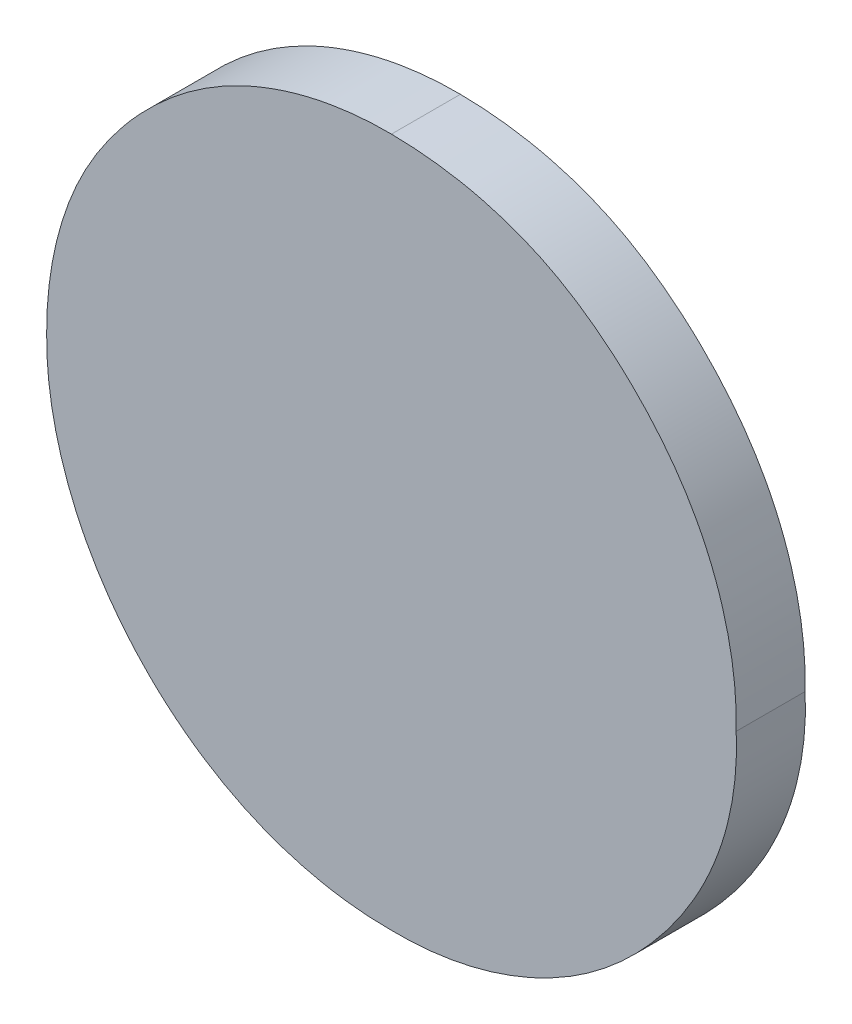
ISO-10303-21;
HEADER;
FILE_DESCRIPTION(('STEP AP214'),'2;1');
FILE_NAME('part.step','',(''),(''),'','','');
FILE_SCHEMA(('AUTOMOTIVE_DESIGN { 1 0 10303 214 1 1 1 1 }'));
ENDSEC;
DATA;
#1=APPLICATION_CONTEXT('core data for automotive mechanical design processes');
#2=APPLICATION_PROTOCOL_DEFINITION('international standard','automotive_design',2000,#1);
#3=PRODUCT_CONTEXT('',#1,'mechanical');
#4=PRODUCT('Part','Part','',(#3));
#5=PRODUCT_RELATED_PRODUCT_CATEGORY('part','',(#4));
#6=PRODUCT_DEFINITION_FORMATION('','',#4);
#7=PRODUCT_DEFINITION_CONTEXT('part definition',#1,'design');
#8=PRODUCT_DEFINITION('design','',#6,#7);
#9=PRODUCT_DEFINITION_SHAPE('','',#8);
#10=(LENGTH_UNIT() NAMED_UNIT(*) SI_UNIT(.MILLI.,.METRE.));
#11=(NAMED_UNIT(*) PLANE_ANGLE_UNIT() SI_UNIT($,.RADIAN.));
#12=(NAMED_UNIT(*) SI_UNIT($,.STERADIAN.) SOLID_ANGLE_UNIT());
#13=UNCERTAINTY_MEASURE_WITH_UNIT(LENGTH_MEASURE(1.E-05),#10,'distance_accuracy_value','');
#14=(GEOMETRIC_REPRESENTATION_CONTEXT(3) GLOBAL_UNCERTAINTY_ASSIGNED_CONTEXT((#13)) GLOBAL_UNIT_ASSIGNED_CONTEXT((#10,
#11,#12)) REPRESENTATION_CONTEXT('',''));
#15=CARTESIAN_POINT('',(0.,0.,0.));
#16=DIRECTION('',(0.,0.,1.));
#17=DIRECTION('',(1.,0.,0.));
#18=AXIS2_PLACEMENT_3D('',#15,#16,#17);
#19=CARTESIAN_POINT('',(0.39923076923077,0.863114725391158,0.551));
#20=CARTESIAN_POINT('',(0.39923076923077,0.863114725391158,0.55));
#21=CARTESIAN_POINT('',(0.399248976646578,0.86345328618512,0.551));
#22=CARTESIAN_POINT('',(0.399248976646578,0.86345328618512,0.55));
#23=CARTESIAN_POINT('',(0.399284524391418,0.864114284585097,0.551));
#24=CARTESIAN_POINT('',(0.399284524391418,0.864114284585097,0.55));
#25=CARTESIAN_POINT('',(0.399572107138592,0.865060554998996,0.551));
#26=CARTESIAN_POINT('',(0.399572107138592,0.865060554998996,0.55));
#27=CARTESIAN_POINT('',(0.400041413628388,0.86592058538614,0.551));
#28=CARTESIAN_POINT('',(0.400041413628388,0.86592058538614,0.55));
#29=CARTESIAN_POINT('',(0.400675791828254,0.86668166961683,0.551));
#30=CARTESIAN_POINT('',(0.400675791828254,0.86668166961683,0.55));
#31=CARTESIAN_POINT('',(0.401439065472057,0.867319166233957,0.551));
#32=CARTESIAN_POINT('',(0.401439065472057,0.867319166233957,0.55));
#33=CARTESIAN_POINT('',(0.402301286132251,0.867783134116351,0.551));
#34=CARTESIAN_POINT('',(0.402301286132251,0.867783134116351,0.55));
#35=CARTESIAN_POINT('',(0.403244821108891,0.868058112610963,0.551));
#36=CARTESIAN_POINT('',(0.403244821108891,0.868058112610963,0.55));
#37=CARTESIAN_POINT('',(0.403896420053132,0.868095527183786,0.551));
#38=CARTESIAN_POINT('',(0.403896420053132,0.868095527183786,0.55));
#39=CARTESIAN_POINT('',(0.404230769230769,0.868114725391158,0.551));
#40=CARTESIAN_POINT('',(0.404230769230769,0.868114725391158,0.55));
#41=B_SPLINE_SURFACE_WITH_KNOTS('',3,1,((#19,#20),(#21,#22),(#23,#24),(#25,#26),(#27,#28),(#29,
#30),(#31,#32),(#33,#34),(#35,#36),(#37,#38),(#39,#40)),.UNSPECIFIED.,.F.,.F.,.F.,(4,1,1,1,1,1,
1,1,4),(2,2),(0.,0.129096958167213,0.25204596725997,0.373904964401992,0.501037835220204,
0.628170706038407,0.751376463409192,0.872426013370454,1.),(0.,1.),.UNSPECIFIED.);
#42=CARTESIAN_POINT('',(0.39923076923077,0.863114725391158,0.549999999999999));
#43=CARTESIAN_POINT('',(0.399229416497527,0.863455179909153,0.549999999999998));
#44=CARTESIAN_POINT('',(0.399261931137011,0.863797818150182,0.549999999999998));
#45=CARTESIAN_POINT('',(0.39941156061862,0.864551506784289,0.549999999999998));
#46=CARTESIAN_POINT('',(0.399547312142089,0.864958950611587,0.549999999999999));
#47=CARTESIAN_POINT('',(0.399928651852269,0.865725440329336,0.549999999999999));
#48=CARTESIAN_POINT('',(0.400175898556821,0.866083644707447,0.549999999999999));
#49=CARTESIAN_POINT('',(0.400803185242246,0.866798794998221,0.549999999999999));
#50=CARTESIAN_POINT('',(0.401199822238856,0.867141460959453,0.55));
#51=CARTESIAN_POINT('',(0.402044650722195,0.867655274628973,0.550000000000002));
#52=CARTESIAN_POINT('',(0.402485184515487,0.867838907435263,0.550000000000002));
#53=CARTESIAN_POINT('',(0.403363138264506,0.868066009062203,0.550000000000004));
#54=CARTESIAN_POINT('',(0.403797973311028,0.868119539716685,0.550000000000004));
#55=CARTESIAN_POINT('',(0.404230769230769,0.868114725391158,0.550000000000005));
#56=B_SPLINE_CURVE_WITH_KNOTS('',3,(#42,#43,#44,#45,#46,#47,#48,#49,#50,#51,#52,#53,#54,#55),
.UNSPECIFIED.,.F.,.F.,(4,2,2,2,2,2,4),(0.,0.00102380235934378,0.0022963706716671,
0.0035885272384339,0.00513641999990452,0.0065474697181893,0.00784533010584649),.UNSPECIFIED.);
#57=CARTESIAN_POINT('',(0.39923076923077,0.863114725391158,0.55));
#58=VERTEX_POINT('',#57);
#59=CARTESIAN_POINT('',(0.404230769230769,0.868114725391158,0.55));
#60=VERTEX_POINT('',#59);
#61=EDGE_CURVE('E11',#58,#60,#56,.T.);
#62=DIRECTION('',(0.,-1.11022302462503E-13,-1.));
#63=VECTOR('',#62,1.);
#64=CARTESIAN_POINT('',(0.39923076923077,0.863114725391158,0.551));
#65=LINE('',#64,#63);
#66=CARTESIAN_POINT('',(0.39923076923077,0.863114725391158,0.551));
#67=VERTEX_POINT('',#66);
#68=EDGE_CURVE('E135',#67,#58,#65,.T.);
#69=CARTESIAN_POINT('',(0.39923076923077,0.863114725391158,0.550999999999998));
#70=CARTESIAN_POINT('',(0.399229416497527,0.863455179909153,0.550999999999998));
#71=CARTESIAN_POINT('',(0.399261931137011,0.863797818150182,0.550999999999998));
#72=CARTESIAN_POINT('',(0.39941156061862,0.864551506784289,0.550999999999998));
#73=CARTESIAN_POINT('',(0.399547312142089,0.864958950611587,0.550999999999999));
#74=CARTESIAN_POINT('',(0.399928651852269,0.865725440329336,0.550999999999999));
#75=CARTESIAN_POINT('',(0.400175898556821,0.866083644707447,0.551));
#76=CARTESIAN_POINT('',(0.400803185242246,0.866798794998221,0.551));
#77=CARTESIAN_POINT('',(0.401199822238856,0.867141460959453,0.551));
#78=CARTESIAN_POINT('',(0.402044650722195,0.867655274628973,0.551000000000001));
#79=CARTESIAN_POINT('',(0.402485184515487,0.867838907435263,0.551000000000002));
#80=CARTESIAN_POINT('',(0.403363138264506,0.868066009062203,0.551000000000004));
#81=CARTESIAN_POINT('',(0.403797973311028,0.868119539716685,0.551000000000004));
#82=CARTESIAN_POINT('',(0.404230769230769,0.868114725391158,0.551000000000005));
#83=B_SPLINE_CURVE_WITH_KNOTS('',3,(#69,#70,#71,#72,#73,#74,#75,#76,#77,#78,#79,#80,#81,#82),
.UNSPECIFIED.,.F.,.F.,(4,2,2,2,2,2,4),(0.,0.00102380235934378,0.0022963706716671,
0.0035885272384339,0.00513641999990452,0.0065474697181893,0.00784533010584649),.UNSPECIFIED.);
#84=CARTESIAN_POINT('',(0.404230769230769,0.868114725391158,0.551));
#85=VERTEX_POINT('',#84);
#86=EDGE_CURVE('E143',#67,#85,#83,.T.);
#87=DIRECTION('',(0.,0.,-1.));
#88=VECTOR('',#87,1.);
#89=CARTESIAN_POINT('',(0.404230769230769,0.868114725391158,0.551));
#90=LINE('',#89,#88);
#91=EDGE_CURVE('E80',#85,#60,#90,.T.);
#92=ORIENTED_EDGE('',*,*,#61,.F.);
#93=ORIENTED_EDGE('',*,*,#68,.F.);
#94=ORIENTED_EDGE('',*,*,#86,.T.);
#95=ORIENTED_EDGE('',*,*,#91,.T.);
#96=EDGE_LOOP('',(#92,#93,#94,#95));
#97=FACE_BOUND('',#96,.T.);
#98=ADVANCED_FACE('F17',(#97),#41,.T.);
#99=CARTESIAN_POINT('',(0.404230769230769,0.858114725391158,0.551));
#100=CARTESIAN_POINT('',(0.404230769230769,0.858114725391158,0.55));
#101=CARTESIAN_POINT('',(0.403896039419594,0.858132615628453,0.551));
#102=CARTESIAN_POINT('',(0.403896039419594,0.858132615628453,0.55));
#103=CARTESIAN_POINT('',(0.403242559146144,0.858167542057975,0.551));
#104=CARTESIAN_POINT('',(0.403242559146144,0.858167542057975,0.55));
#105=CARTESIAN_POINT('',(0.402303370673627,0.858461761594175,0.551));
#106=CARTESIAN_POINT('',(0.402303370673627,0.858461761594175,0.55));
#107=CARTESIAN_POINT('',(0.401439251212277,0.858921592341211,0.551));
#108=CARTESIAN_POINT('',(0.401439251212277,0.858921592341211,0.55));
#109=CARTESIAN_POINT('',(0.400671461868215,0.859560453646627,0.551));
#110=CARTESIAN_POINT('',(0.400671461868215,0.859560453646627,0.55));
#111=CARTESIAN_POINT('',(0.400045088069561,0.860331884676267,0.551));
#112=CARTESIAN_POINT('',(0.400045088069561,0.860331884676267,0.55));
#113=CARTESIAN_POINT('',(0.399571510077796,0.861192486900813,0.551));
#114=CARTESIAN_POINT('',(0.399571510077796,0.861192486900813,0.55));
#115=CARTESIAN_POINT('',(0.399287107524317,0.862131597256498,0.551));
#116=CARTESIAN_POINT('',(0.399287107524317,0.862131597256498,0.55));
#117=CARTESIAN_POINT('',(0.399249703992885,0.862784305419475,0.551));
#118=CARTESIAN_POINT('',(0.399249703992885,0.862784305419475,0.55));
#119=CARTESIAN_POINT('',(0.39923076923077,0.863114725391158,0.551));
#120=CARTESIAN_POINT('',(0.39923076923077,0.863114725391158,0.55));
#121=B_SPLINE_SURFACE_WITH_KNOTS('',3,1,((#99,#100),(#101,#102),(#103,#104),(#105,#106),(#107,
#108),(#109,#110),(#111,#112),(#113,#114),(#115,#116),(#117,#118),(#119,#120)),.UNSPECIFIED.,
.F.,.F.,.F.,(4,1,1,1,1,1,1,1,4),(2,2),(0.,0.127756603310128,0.24941435533653,0.37279647645539,
0.500111332515853,0.628609940765106,0.750643373825806,0.873768379142504,1.),(0.,1.),.UNSPECIFIED.);
#122=CARTESIAN_POINT('',(0.404230769230769,0.858114725391158,0.550000000000007));
#123=CARTESIAN_POINT('',(0.403893267940405,0.858112502108592,0.550000000000007));
#124=CARTESIAN_POINT('',(0.40355517942209,0.858145582789583,0.550000000000006));
#125=CARTESIAN_POINT('',(0.402814894762664,0.858295330803168,0.550000000000005));
#126=CARTESIAN_POINT('',(0.402416205449739,0.858429742888755,0.550000000000005));
#127=CARTESIAN_POINT('',(0.401597885990938,0.858830577938308,0.550000000000003));
#128=CARTESIAN_POINT('',(0.401187846528188,0.859116704584057,0.550000000000003));
#129=CARTESIAN_POINT('',(0.40046227781435,0.859795571446889,0.550000000000001));
#130=CARTESIAN_POINT('',(0.400147659108904,0.860189274590438,0.550000000000001));
#131=CARTESIAN_POINT('',(0.399652955060885,0.86104222215107,0.549999999999999));
#132=CARTESIAN_POINT('',(0.399469879770227,0.861499707407872,0.549999999999999));
#133=CARTESIAN_POINT('',(0.399269705395969,0.862347008753727,0.549999999999999));
#134=CARTESIAN_POINT('',(0.399225701117548,0.862730685884953,0.549999999999999));
#135=CARTESIAN_POINT('',(0.39923076923077,0.863114725391158,0.549999999999999));
#136=B_SPLINE_CURVE_WITH_KNOTS('',3,(#122,#123,#124,#125,#126,#127,#128,#129,#130,#131,#132,
#133,#134,#135),.UNSPECIFIED.,.F.,.F.,(4,2,2,2,2,2,4),(0.,0.00101171540563026,
0.00226012530857961,0.00373770364104088,0.00522896754963452,0.00668515982761436,
0.00783352206638498),.UNSPECIFIED.);
#137=CARTESIAN_POINT('',(0.404230769230769,0.858114725391158,0.55));
#138=VERTEX_POINT('',#137);
#139=EDGE_CURVE('E32',#138,#58,#136,.T.);
#140=DIRECTION('',(0.,0.,-1.));
#141=VECTOR('',#140,1.);
#142=CARTESIAN_POINT('',(0.404230769230769,0.858114725391158,0.551));
#143=LINE('',#142,#141);
#144=CARTESIAN_POINT('',(0.404230769230769,0.858114725391158,0.551));
#145=VERTEX_POINT('',#144);
#146=EDGE_CURVE('E142',#145,#138,#143,.T.);
#147=CARTESIAN_POINT('',(0.404230769230769,0.858114725391158,0.551000000000007));
#148=CARTESIAN_POINT('',(0.403893267940405,0.858112502108592,0.551000000000007));
#149=CARTESIAN_POINT('',(0.40355517942209,0.858145582789583,0.551000000000006));
#150=CARTESIAN_POINT('',(0.402814894762664,0.858295330803168,0.551000000000005));
#151=CARTESIAN_POINT('',(0.402416205449739,0.858429742888755,0.551000000000005));
#152=CARTESIAN_POINT('',(0.401597885990938,0.858830577938308,0.551000000000003));
#153=CARTESIAN_POINT('',(0.401187846528188,0.859116704584057,0.551000000000003));
#154=CARTESIAN_POINT('',(0.40046227781435,0.859795571446889,0.551000000000001));
#155=CARTESIAN_POINT('',(0.400147659108904,0.860189274590438,0.551));
#156=CARTESIAN_POINT('',(0.399652955060885,0.86104222215107,0.550999999999999));
#157=CARTESIAN_POINT('',(0.399469879770227,0.861499707407872,0.550999999999999));
#158=CARTESIAN_POINT('',(0.399269705395969,0.862347008753727,0.550999999999999));
#159=CARTESIAN_POINT('',(0.399225701117548,0.862730685884953,0.550999999999998));
#160=CARTESIAN_POINT('',(0.39923076923077,0.863114725391158,0.550999999999998));
#161=B_SPLINE_CURVE_WITH_KNOTS('',3,(#147,#148,#149,#150,#151,#152,#153,#154,#155,#156,#157,
#158,#159,#160),.UNSPECIFIED.,.F.,.F.,(4,2,2,2,2,2,4),(0.,0.00101171540563026,
0.00226012530857961,0.00373770364104088,0.00522896754963452,0.00668515982761436,
0.00783352206638498),.UNSPECIFIED.);
#162=EDGE_CURVE('E74',#145,#67,#161,.T.);
#163=ORIENTED_EDGE('',*,*,#139,.F.);
#164=ORIENTED_EDGE('',*,*,#146,.F.);
#165=ORIENTED_EDGE('',*,*,#162,.T.);
#166=ORIENTED_EDGE('',*,*,#68,.T.);
#167=EDGE_LOOP('',(#163,#164,#165,#166));
#168=FACE_BOUND('',#167,.T.);
#169=ADVANCED_FACE('F118',(#168),#121,.T.);
#170=CARTESIAN_POINT('',(0.40923076923077,0.863114725391158,0.551));
#171=CARTESIAN_POINT('',(0.40923076923077,0.863114725391158,0.55));
#172=CARTESIAN_POINT('',(0.40921027321799,0.862784839738087,0.551));
#173=CARTESIAN_POINT('',(0.40921027321799,0.862784839738087,0.55));
#174=CARTESIAN_POINT('',(0.409169855381791,0.862134310074904,0.551));
#175=CARTESIAN_POINT('',(0.409169855381791,0.862134310074904,0.55));
#176=CARTESIAN_POINT('',(0.408908210671009,0.861186627858494,0.551));
#177=CARTESIAN_POINT('',(0.408908210671009,0.861186627858494,0.55));
#178=CARTESIAN_POINT('',(0.408412815524208,0.860335880924721,0.551));
#179=CARTESIAN_POINT('',(0.408412815524208,0.860335880924721,0.55));
#180=CARTESIAN_POINT('',(0.407791644216968,0.859559272842521,0.551));
#181=CARTESIAN_POINT('',(0.407791644216968,0.859559272842521,0.55));
#182=CARTESIAN_POINT('',(0.40702370535597,0.858926000774952,0.551));
#183=CARTESIAN_POINT('',(0.40702370535597,0.858926000774952,0.55));
#184=CARTESIAN_POINT('',(0.406164816560152,0.858455886293827,0.551));
#185=CARTESIAN_POINT('',(0.406164816560152,0.858455886293827,0.55));
#186=CARTESIAN_POINT('',(0.405222109277459,0.858169738066809,0.551));
#187=CARTESIAN_POINT('',(0.405222109277459,0.858169738066809,0.55));
#188=CARTESIAN_POINT('',(0.404565258020061,0.858133287259344,0.551));
#189=CARTESIAN_POINT('',(0.404565258020061,0.858133287259344,0.55));
#190=CARTESIAN_POINT('',(0.404230769230769,0.858114725391158,0.551));
#191=CARTESIAN_POINT('',(0.404230769230769,0.858114725391158,0.55));
#192=B_SPLINE_SURFACE_WITH_KNOTS('',3,1,((#170,#171),(#172,#173),(#174,#175),(#176,#177),(#178,
#179),(#180,#181),(#182,#183),(#184,#185),(#186,#187),(#188,#189),(#190,#191)),.UNSPECIFIED.,
.F.,.F.,.F.,(4,1,1,1,1,1,1,1,4),(2,2),(0.,0.126177718317016,0.248820607485794,0.371539969235151,
0.499983706910883,0.627244197875373,0.749225521076267,0.872297950417653,1.),(0.,1.),.UNSPECIFIED.);
#193=CARTESIAN_POINT('',(0.40923076923077,0.863114725391158,0.550000000000014));
#194=CARTESIAN_POINT('',(0.409266179268415,0.862311284791075,0.550000000000014));
#195=CARTESIAN_POINT('',(0.409067723776707,0.8615495939592,0.550000000000014));
#196=CARTESIAN_POINT('',(0.408525951501408,0.86051718944485,0.550000000000014));
#197=CARTESIAN_POINT('',(0.408298908866208,0.860187034192151,0.550000000000014));
#198=CARTESIAN_POINT('',(0.407732286040191,0.859524243865001,0.550000000000012));
#199=CARTESIAN_POINT('',(0.407379595813053,0.859202712064018,0.550000000000011));
#200=CARTESIAN_POINT('',(0.406572495072277,0.858659623609572,0.55000000000001));
#201=CARTESIAN_POINT('',(0.406113429946505,0.858444815631757,0.55000000000001));
#202=CARTESIAN_POINT('',(0.40517827731357,0.858171685319066,0.55000000000001));
#203=CARTESIAN_POINT('',(0.404704438325925,0.858105557819452,0.550000000000009));
#204=CARTESIAN_POINT('',(0.404230769230769,0.858114725391158,0.550000000000007));
#205=B_SPLINE_CURVE_WITH_KNOTS('',3,(#193,#194,#195,#196,#197,#198,#199,#200,#201,#202,#203,
#204),.UNSPECIFIED.,.F.,.F.,(4,2,2,2,2,4),(0.,0.00230515943148697,0.00349686753796256,
0.00491163967330806,0.00640711009768402,0.00782203466010385),.UNSPECIFIED.);
#206=CARTESIAN_POINT('',(0.40923076923077,0.863114725391158,0.55));
#207=VERTEX_POINT('',#206);
#208=EDGE_CURVE('E70',#207,#138,#205,.T.);
#209=DIRECTION('',(0.,-1.11022302462503E-13,-1.));
#210=VECTOR('',#209,1.);
#211=CARTESIAN_POINT('',(0.40923076923077,0.863114725391158,0.551));
#212=LINE('',#211,#210);
#213=CARTESIAN_POINT('',(0.40923076923077,0.863114725391158,0.551));
#214=VERTEX_POINT('',#213);
#215=EDGE_CURVE('E63',#214,#207,#212,.T.);
#216=CARTESIAN_POINT('',(0.40923076923077,0.863114725391158,0.551000000000014));
#217=CARTESIAN_POINT('',(0.409266179268415,0.862311284791075,0.551000000000014));
#218=CARTESIAN_POINT('',(0.409067723776707,0.8615495939592,0.551000000000014));
#219=CARTESIAN_POINT('',(0.408525951501408,0.86051718944485,0.551000000000014));
#220=CARTESIAN_POINT('',(0.408298908866208,0.860187034192151,0.551000000000013));
#221=CARTESIAN_POINT('',(0.407732286040191,0.859524243865001,0.551000000000012));
#222=CARTESIAN_POINT('',(0.407379595813053,0.859202712064018,0.551000000000012));
#223=CARTESIAN_POINT('',(0.406572495072277,0.858659623609572,0.55100000000001));
#224=CARTESIAN_POINT('',(0.406113429946505,0.858444815631757,0.55100000000001));
#225=CARTESIAN_POINT('',(0.40517827731357,0.858171685319066,0.551000000000008));
#226=CARTESIAN_POINT('',(0.404704438325925,0.858105557819452,0.551000000000008));
#227=CARTESIAN_POINT('',(0.404230769230769,0.858114725391158,0.551000000000007));
#228=B_SPLINE_CURVE_WITH_KNOTS('',3,(#216,#217,#218,#219,#220,#221,#222,#223,#224,#225,#226,
#227),.UNSPECIFIED.,.F.,.F.,(4,2,2,2,2,4),(0.,0.00230515943148697,0.00349686753796256,
0.00491163967330806,0.00640711009768402,0.00782203466010385),.UNSPECIFIED.);
#229=EDGE_CURVE('E67',#214,#145,#228,.T.);
#230=ORIENTED_EDGE('',*,*,#208,.F.);
#231=ORIENTED_EDGE('',*,*,#215,.F.);
#232=ORIENTED_EDGE('',*,*,#229,.T.);
#233=ORIENTED_EDGE('',*,*,#146,.T.);
#234=EDGE_LOOP('',(#230,#231,#232,#233));
#235=FACE_BOUND('',#234,.T.);
#236=ADVANCED_FACE('F65',(#235),#192,.T.);
#237=CARTESIAN_POINT('',(0.404230769230769,0.868114725391158,0.551));
#238=CARTESIAN_POINT('',(0.404230769230769,0.868114725391158,0.55));
#239=CARTESIAN_POINT('',(0.404564887153735,0.868094871105105,0.551));
#240=CARTESIAN_POINT('',(0.404564887153735,0.868094871105105,0.55));
#241=CARTESIAN_POINT('',(0.405219886280483,0.868055949098432,0.551));
#242=CARTESIAN_POINT('',(0.405219886280483,0.868055949098432,0.55));
#243=CARTESIAN_POINT('',(0.406166842765899,0.867788920405405,0.551));
#244=CARTESIAN_POINT('',(0.406166842765899,0.867788920405405,0.55));
#245=CARTESIAN_POINT('',(0.407023894075273,0.867314771940176,0.551));
#246=CARTESIAN_POINT('',(0.407023894075273,0.867314771940176,0.55));
#247=CARTESIAN_POINT('',(0.407787303985903,0.866682838596831,0.551));
#248=CARTESIAN_POINT('',(0.407787303985903,0.866682838596831,0.55));
#249=CARTESIAN_POINT('',(0.408416557869175,0.865916627228879,0.551));
#250=CARTESIAN_POINT('',(0.408416557869175,0.865916627228879,0.55));
#251=CARTESIAN_POINT('',(0.408907603905652,0.865066411650546,0.551));
#252=CARTESIAN_POINT('',(0.408907603905652,0.865066411650546,0.55));
#253=CARTESIAN_POINT('',(0.409172306509286,0.864111527206334,0.551));
#254=CARTESIAN_POINT('',(0.409172306509286,0.864111527206334,0.55));
#255=CARTESIAN_POINT('',(0.409210944997468,0.863452732778397,0.551));
#256=CARTESIAN_POINT('',(0.409210944997468,0.863452732778397,0.55));
#257=CARTESIAN_POINT('',(0.40923076923077,0.863114725391158,0.551));
#258=CARTESIAN_POINT('',(0.40923076923077,0.863114725391158,0.55));
#259=B_SPLINE_SURFACE_WITH_KNOTS('',3,1,((#237,#238),(#239,#240),(#241,#242),(#243,#244),(#245,
#246),(#247,#248),(#249,#250),(#251,#252),(#253,#254),(#255,#256),(#257,#258)),.UNSPECIFIED.,
.F.,.F.,.F.,(4,1,1,1,1,1,1,1,4),(2,2),(0.,0.127518926699944,0.249985947748807,0.371792351505759,
0.498870352776476,0.625948354047203,0.748491738016065,0.87095875906493,1.),(0.,1.),.UNSPECIFIED.);
#260=CARTESIAN_POINT('',(0.404230769230769,0.868114725391158,0.550000000000005));
#261=CARTESIAN_POINT('',(0.404565943435557,0.868112097167233,0.550000000000006));
#262=CARTESIAN_POINT('',(0.404904835685436,0.86808049207193,0.550000000000006));
#263=CARTESIAN_POINT('',(0.405676933052458,0.867933136152945,0.550000000000008));
#264=CARTESIAN_POINT('',(0.406105800377027,0.867793791823817,0.550000000000009));
#265=CARTESIAN_POINT('',(0.406885428723778,0.867397345513137,0.550000000000009));
#266=CARTESIAN_POINT('',(0.40723837676596,0.867144479411953,0.55000000000001));
#267=CARTESIAN_POINT('',(0.407951045995354,0.866502517795435,0.550000000000011));
#268=CARTESIAN_POINT('',(0.408294852138018,0.86609563777763,0.550000000000011));
#269=CARTESIAN_POINT('',(0.40878761986035,0.865264762391322,0.550000000000013));
#270=CARTESIAN_POINT('',(0.408959226674588,0.864854403753308,0.550000000000013));
#271=CARTESIAN_POINT('',(0.409186066598336,0.864000714530884,0.550000000000013));
#272=CARTESIAN_POINT('',(0.409240747435176,0.863557237666799,0.550000000000013));
#273=CARTESIAN_POINT('',(0.40923076923077,0.863114725391158,0.550000000000014));
#274=B_SPLINE_CURVE_WITH_KNOTS('',3,(#260,#261,#262,#263,#264,#265,#266,#267,#268,#269,#270,
#271,#272,#273),.UNSPECIFIED.,.F.,.F.,(4,2,2,2,2,2,4),(0.,0.00101182088140826,
0.00234589379881107,0.00363386383792711,0.00520796923801979,0.00652511171315622,
0.00784846178707324),.UNSPECIFIED.);
#275=EDGE_CURVE('E73',#60,#207,#274,.T.);
#276=CARTESIAN_POINT('',(0.404230769230769,0.868114725391158,0.551000000000005));
#277=CARTESIAN_POINT('',(0.404565943435557,0.868112097167233,0.551000000000006));
#278=CARTESIAN_POINT('',(0.404904835685436,0.86808049207193,0.551000000000006));
#279=CARTESIAN_POINT('',(0.405676933052458,0.867933136152945,0.551000000000008));
#280=CARTESIAN_POINT('',(0.406105800377027,0.867793791823817,0.551000000000008));
#281=CARTESIAN_POINT('',(0.406885428723778,0.867397345513137,0.551000000000009));
#282=CARTESIAN_POINT('',(0.40723837676596,0.867144479411953,0.551000000000009));
#283=CARTESIAN_POINT('',(0.407951045995354,0.866502517795435,0.55100000000001));
#284=CARTESIAN_POINT('',(0.408294852138018,0.86609563777763,0.551000000000011));
#285=CARTESIAN_POINT('',(0.40878761986035,0.865264762391322,0.551000000000012));
#286=CARTESIAN_POINT('',(0.408959226674588,0.864854403753308,0.551000000000013));
#287=CARTESIAN_POINT('',(0.409186066598336,0.864000714530884,0.551000000000013));
#288=CARTESIAN_POINT('',(0.409240747435176,0.863557237666799,0.551000000000013));
#289=CARTESIAN_POINT('',(0.40923076923077,0.863114725391158,0.551000000000014));
#290=B_SPLINE_CURVE_WITH_KNOTS('',3,(#276,#277,#278,#279,#280,#281,#282,#283,#284,#285,#286,
#287,#288,#289),.UNSPECIFIED.,.F.,.F.,(4,2,2,2,2,2,4),(0.,0.00101182088140826,
0.00234589379881107,0.00363386383792711,0.00520796923801979,0.00652511171315622,
0.00784846178707324),.UNSPECIFIED.);
#291=EDGE_CURVE('E78',#85,#214,#290,.T.);
#292=ORIENTED_EDGE('',*,*,#275,.F.);
#293=ORIENTED_EDGE('',*,*,#91,.F.);
#294=ORIENTED_EDGE('',*,*,#291,.T.);
#295=ORIENTED_EDGE('',*,*,#215,.T.);
#296=EDGE_LOOP('',(#292,#293,#294,#295));
#297=FACE_BOUND('',#296,.T.);
#298=ADVANCED_FACE('F79',(#297),#259,.T.);
#299=CARTESIAN_POINT('',(0.400691346143458,0.866654615006806,0.551));
#300=DIRECTION('',(-3.09070669770512E-12,4.86453252035292E-13,1.));
#301=DIRECTION('',(1.,0.,3.09070669770512E-12));
#302=AXIS2_PLACEMENT_3D('',#299,#300,#301);
#303=PLANE('',#302);
#304=ORIENTED_EDGE('',*,*,#86,.F.);
#305=ORIENTED_EDGE('',*,*,#162,.F.);
#306=ORIENTED_EDGE('',*,*,#229,.F.);
#307=ORIENTED_EDGE('',*,*,#291,.F.);
#308=EDGE_LOOP('',(#304,#305,#306,#307));
#309=FACE_BOUND('',#308,.T.);
#310=ADVANCED_FACE('F84',(#309),#303,.T.);
#311=CARTESIAN_POINT('',(0.400691346143458,0.866654615006806,0.55));
#312=DIRECTION('',(-3.09070669770512E-12,4.86453252035292E-13,1.));
#313=DIRECTION('',(1.,0.,3.09070669770512E-12));
#314=AXIS2_PLACEMENT_3D('',#311,#312,#313);
#315=PLANE('',#314);
#316=ORIENTED_EDGE('',*,*,#61,.T.);
#317=ORIENTED_EDGE('',*,*,#275,.T.);
#318=ORIENTED_EDGE('',*,*,#208,.T.);
#319=ORIENTED_EDGE('',*,*,#139,.T.);
#320=EDGE_LOOP('',(#316,#317,#318,#319));
#321=FACE_BOUND('',#320,.T.);
#322=ADVANCED_FACE('F105',(#321),#315,.F.);
#323=CLOSED_SHELL('',(#98,#169,#236,#298,#310,#322));
#324=MANIFOLD_SOLID_BREP('B1',#323);
#325=ADVANCED_BREP_SHAPE_REPRESENTATION('',(#18,#324),#14);
#326=SHAPE_DEFINITION_REPRESENTATION(#9,#325);
ENDSEC;
END-ISO-10303-21;
